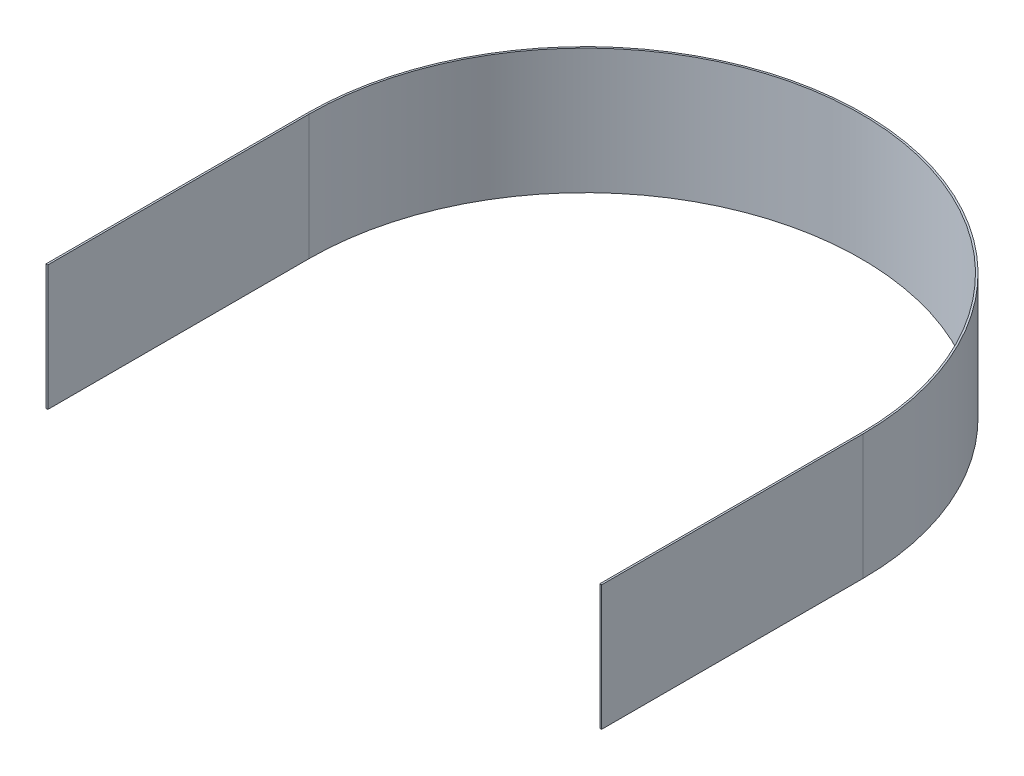
ISO-10303-21;
HEADER;
FILE_DESCRIPTION(('STEP AP214'),'2;1');
FILE_NAME('part.step','',(''),(''),'','','');
FILE_SCHEMA(('AUTOMOTIVE_DESIGN { 1 0 10303 214 1 1 1 1 }'));
ENDSEC;
DATA;
#1=APPLICATION_CONTEXT('core data for automotive mechanical design processes');
#2=APPLICATION_PROTOCOL_DEFINITION('international standard','automotive_design',2000,#1);
#3=PRODUCT_CONTEXT('',#1,'mechanical');
#4=PRODUCT('Part','Part','',(#3));
#5=PRODUCT_RELATED_PRODUCT_CATEGORY('part','',(#4));
#6=PRODUCT_DEFINITION_FORMATION('','',#4);
#7=PRODUCT_DEFINITION_CONTEXT('part definition',#1,'design');
#8=PRODUCT_DEFINITION('design','',#6,#7);
#9=PRODUCT_DEFINITION_SHAPE('','',#8);
#10=(LENGTH_UNIT() NAMED_UNIT(*) SI_UNIT(.MILLI.,.METRE.));
#11=(NAMED_UNIT(*) PLANE_ANGLE_UNIT() SI_UNIT($,.RADIAN.));
#12=(NAMED_UNIT(*) SI_UNIT($,.STERADIAN.) SOLID_ANGLE_UNIT());
#13=UNCERTAINTY_MEASURE_WITH_UNIT(LENGTH_MEASURE(1.E-05),#10,'distance_accuracy_value','');
#14=(GEOMETRIC_REPRESENTATION_CONTEXT(3) GLOBAL_UNCERTAINTY_ASSIGNED_CONTEXT((#13)) GLOBAL_UNIT_ASSIGNED_CONTEXT((#10,
#11,#12)) REPRESENTATION_CONTEXT('',''));
#15=CARTESIAN_POINT('',(0.,0.,0.));
#16=DIRECTION('',(0.,0.,1.));
#17=DIRECTION('',(1.,0.,0.));
#18=AXIS2_PLACEMENT_3D('',#15,#16,#17);
#19=CARTESIAN_POINT('',(-154.328377409543,70.,146.0327375181));
#20=DIRECTION('',(-1.,0.,0.));
#21=DIRECTION('',(0.,0.,1.));
#22=AXIS2_PLACEMENT_3D('',#19,#20,#21);
#23=PLANE('',#22);
#24=DIRECTION('',(0.,0.,-1.));
#25=VECTOR('',#24,1.);
#26=CARTESIAN_POINT('',(-154.328377409543,0.,146.0327375181));
#27=LINE('',#26,#25);
#28=CARTESIAN_POINT('',(-154.328377409543,0.,146.0327375181));
#29=VERTEX_POINT('',#28);
#30=CARTESIAN_POINT('',(-154.328377409543,0.,0.));
#31=VERTEX_POINT('',#30);
#32=EDGE_CURVE('E128',#29,#31,#27,.T.);
#33=ORIENTED_EDGE('',*,*,#32,.T.);
#34=DIRECTION('',(0.,-1.,0.));
#35=VECTOR('',#34,1.);
#36=CARTESIAN_POINT('',(-154.328377409543,70.,0.));
#37=LINE('',#36,#35);
#38=CARTESIAN_POINT('',(-154.328377409543,70.,0.));
#39=VERTEX_POINT('',#38);
#40=EDGE_CURVE('E11',#39,#31,#37,.T.);
#41=ORIENTED_EDGE('',*,*,#40,.F.);
#42=DIRECTION('',(0.,0.,-1.));
#43=VECTOR('',#42,1.);
#44=CARTESIAN_POINT('',(-154.328377409543,70.,146.0327375181));
#45=LINE('',#44,#43);
#46=CARTESIAN_POINT('',(-154.328377409543,70.,146.0327375181));
#47=VERTEX_POINT('',#46);
#48=EDGE_CURVE('E142',#47,#39,#45,.T.);
#49=ORIENTED_EDGE('',*,*,#48,.F.);
#50=DIRECTION('',(0.,-1.,0.));
#51=VECTOR('',#50,1.);
#52=CARTESIAN_POINT('',(-154.328377409543,70.,146.0327375181));
#53=LINE('',#52,#51);
#54=EDGE_CURVE('E124',#47,#29,#53,.T.);
#55=ORIENTED_EDGE('',*,*,#54,.T.);
#56=EDGE_LOOP('',(#33,#41,#49,#55));
#57=FACE_BOUND('',#56,.T.);
#58=ADVANCED_FACE('F32',(#57),#23,.F.);
#59=CARTESIAN_POINT('',(0.,70.,0.));
#60=DIRECTION('',(0.,-1.,0.));
#61=DIRECTION('',(0.,0.,-1.));
#62=AXIS2_PLACEMENT_3D('',#59,#60,#61);
#63=CYLINDRICAL_SURFACE('',#62,154.328377409543);
#64=CARTESIAN_POINT('',(0.,0.,0.));
#65=DIRECTION('',(0.,-1.,0.));
#66=DIRECTION('',(0.,0.,-1.));
#67=AXIS2_PLACEMENT_3D('',#64,#65,#66);
#68=CIRCLE('',#67,154.328377409543);
#69=CARTESIAN_POINT('',(154.328377409543,0.,0.));
#70=VERTEX_POINT('',#69);
#71=EDGE_CURVE('E131',#31,#70,#68,.T.);
#72=ORIENTED_EDGE('',*,*,#71,.T.);
#73=DIRECTION('',(0.,-1.,0.));
#74=VECTOR('',#73,1.);
#75=CARTESIAN_POINT('',(154.328377409543,70.,0.));
#76=LINE('',#75,#74);
#77=CARTESIAN_POINT('',(154.328377409543,70.,0.));
#78=VERTEX_POINT('',#77);
#79=EDGE_CURVE('E40',#78,#70,#76,.T.);
#80=ORIENTED_EDGE('',*,*,#79,.F.);
#81=CARTESIAN_POINT('',(0.,70.,0.));
#82=DIRECTION('',(0.,-1.,0.));
#83=DIRECTION('',(0.,0.,-1.));
#84=AXIS2_PLACEMENT_3D('',#81,#82,#83);
#85=CIRCLE('',#84,154.328377409543);
#86=EDGE_CURVE('E91',#39,#78,#85,.T.);
#87=ORIENTED_EDGE('',*,*,#86,.F.);
#88=ORIENTED_EDGE('',*,*,#40,.T.);
#89=EDGE_LOOP('',(#72,#80,#87,#88));
#90=FACE_BOUND('',#89,.T.);
#91=ADVANCED_FACE('F177',(#90),#63,.F.);
#92=CARTESIAN_POINT('',(154.328377409543,70.,146.07627046515));
#93=DIRECTION('',(1.,0.,0.));
#94=DIRECTION('',(0.,0.,-1.));
#95=AXIS2_PLACEMENT_3D('',#92,#93,#94);
#96=PLANE('',#95);
#97=DIRECTION('',(0.,0.,1.));
#98=VECTOR('',#97,1.);
#99=CARTESIAN_POINT('',(154.328377409543,0.,146.07627046515));
#100=LINE('',#99,#98);
#101=CARTESIAN_POINT('',(154.328377409543,0.,146.07627046515));
#102=VERTEX_POINT('',#101);
#103=EDGE_CURVE('E133',#70,#102,#100,.T.);
#104=ORIENTED_EDGE('',*,*,#103,.T.);
#105=DIRECTION('',(0.,-1.,0.));
#106=VECTOR('',#105,1.);
#107=CARTESIAN_POINT('',(154.328377409543,70.,146.07627046515));
#108=LINE('',#107,#106);
#109=CARTESIAN_POINT('',(154.328377409543,70.,146.07627046515));
#110=VERTEX_POINT('',#109);
#111=EDGE_CURVE('E149',#110,#102,#108,.T.);
#112=ORIENTED_EDGE('',*,*,#111,.F.);
#113=DIRECTION('',(0.,0.,1.));
#114=VECTOR('',#113,1.);
#115=CARTESIAN_POINT('',(154.328377409543,70.,146.07627046515));
#116=LINE('',#115,#114);
#117=EDGE_CURVE('E157',#78,#110,#116,.T.);
#118=ORIENTED_EDGE('',*,*,#117,.F.);
#119=ORIENTED_EDGE('',*,*,#79,.T.);
#120=EDGE_LOOP('',(#104,#112,#118,#119));
#121=FACE_BOUND('',#120,.T.);
#122=ADVANCED_FACE('F155',(#121),#96,.F.);
#123=CARTESIAN_POINT('',(154.328377409543,70.,146.07627046515));
#124=DIRECTION('',(0.,0.,-1.));
#125=DIRECTION('',(-1.,0.,0.));
#126=AXIS2_PLACEMENT_3D('',#123,#124,#125);
#127=PLANE('',#126);
#128=DIRECTION('',(1.,0.,0.));
#129=VECTOR('',#128,1.);
#130=CARTESIAN_POINT('',(154.328377409543,0.,146.07627046515));
#131=LINE('',#130,#129);
#132=CARTESIAN_POINT('',(155.328377409543,0.,146.07627046515));
#133=VERTEX_POINT('',#132);
#134=EDGE_CURVE('E135',#102,#133,#131,.T.);
#135=ORIENTED_EDGE('',*,*,#134,.T.);
#136=DIRECTION('',(0.,-1.,0.));
#137=VECTOR('',#136,1.);
#138=CARTESIAN_POINT('',(155.328377409543,70.,146.07627046515));
#139=LINE('',#138,#137);
#140=CARTESIAN_POINT('',(155.328377409543,70.,146.07627046515));
#141=VERTEX_POINT('',#140);
#142=EDGE_CURVE('E146',#141,#133,#139,.T.);
#143=ORIENTED_EDGE('',*,*,#142,.F.);
#144=DIRECTION('',(1.,0.,0.));
#145=VECTOR('',#144,1.);
#146=CARTESIAN_POINT('',(154.328377409543,70.,146.07627046515));
#147=LINE('',#146,#145);
#148=EDGE_CURVE('E169',#110,#141,#147,.T.);
#149=ORIENTED_EDGE('',*,*,#148,.F.);
#150=ORIENTED_EDGE('',*,*,#111,.T.);
#151=EDGE_LOOP('',(#135,#143,#149,#150));
#152=FACE_BOUND('',#151,.T.);
#153=ADVANCED_FACE('F165',(#152),#127,.F.);
#154=CARTESIAN_POINT('',(155.328377409543,70.,146.07627046515));
#155=DIRECTION('',(-1.,0.,0.));
#156=DIRECTION('',(0.,0.,1.));
#157=AXIS2_PLACEMENT_3D('',#154,#155,#156);
#158=PLANE('',#157);
#159=DIRECTION('',(0.,0.,-1.));
#160=VECTOR('',#159,1.);
#161=CARTESIAN_POINT('',(155.328377409543,0.,146.07627046515));
#162=LINE('',#161,#160);
#163=CARTESIAN_POINT('',(155.328377409543,0.,0.));
#164=VERTEX_POINT('',#163);
#165=EDGE_CURVE('E137',#133,#164,#162,.T.);
#166=ORIENTED_EDGE('',*,*,#165,.T.);
#167=DIRECTION('',(0.,-1.,0.));
#168=VECTOR('',#167,1.);
#169=CARTESIAN_POINT('',(155.328377409543,70.,0.));
#170=LINE('',#169,#168);
#171=CARTESIAN_POINT('',(155.328377409543,70.,0.));
#172=VERTEX_POINT('',#171);
#173=EDGE_CURVE('E119',#172,#164,#170,.T.);
#174=ORIENTED_EDGE('',*,*,#173,.F.);
#175=DIRECTION('',(0.,0.,-1.));
#176=VECTOR('',#175,1.);
#177=CARTESIAN_POINT('',(155.328377409543,70.,146.07627046515));
#178=LINE('',#177,#176);
#179=EDGE_CURVE('E110',#141,#172,#178,.T.);
#180=ORIENTED_EDGE('',*,*,#179,.F.);
#181=ORIENTED_EDGE('',*,*,#142,.T.);
#182=EDGE_LOOP('',(#166,#174,#180,#181));
#183=FACE_BOUND('',#182,.T.);
#184=ADVANCED_FACE('F168',(#183),#158,.F.);
#185=CARTESIAN_POINT('',(0.,70.,0.));
#186=DIRECTION('',(0.,-1.,0.));
#187=DIRECTION('',(0.,0.,-1.));
#188=AXIS2_PLACEMENT_3D('',#185,#186,#187);
#189=CYLINDRICAL_SURFACE('',#188,155.328377409543);
#190=CARTESIAN_POINT('',(0.,0.,0.));
#191=DIRECTION('',(0.,1.,0.));
#192=DIRECTION('',(0.,0.,-1.));
#193=AXIS2_PLACEMENT_3D('',#190,#191,#192);
#194=CIRCLE('',#193,155.328377409543);
#195=CARTESIAN_POINT('',(-155.328377409543,0.,0.));
#196=VERTEX_POINT('',#195);
#197=EDGE_CURVE('E118',#164,#196,#194,.T.);
#198=ORIENTED_EDGE('',*,*,#197,.T.);
#199=DIRECTION('',(0.,-1.,0.));
#200=VECTOR('',#199,1.);
#201=CARTESIAN_POINT('',(-155.328377409543,70.,0.));
#202=LINE('',#201,#200);
#203=CARTESIAN_POINT('',(-155.328377409543,70.,0.));
#204=VERTEX_POINT('',#203);
#205=EDGE_CURVE('E115',#204,#196,#202,.T.);
#206=ORIENTED_EDGE('',*,*,#205,.F.);
#207=CARTESIAN_POINT('',(0.,70.,0.));
#208=DIRECTION('',(0.,1.,0.));
#209=DIRECTION('',(0.,0.,-1.));
#210=AXIS2_PLACEMENT_3D('',#207,#208,#209);
#211=CIRCLE('',#210,155.328377409543);
#212=EDGE_CURVE('E104',#172,#204,#211,.T.);
#213=ORIENTED_EDGE('',*,*,#212,.F.);
#214=ORIENTED_EDGE('',*,*,#173,.T.);
#215=EDGE_LOOP('',(#198,#206,#213,#214));
#216=FACE_BOUND('',#215,.T.);
#217=ADVANCED_FACE('F116',(#216),#189,.T.);
#218=CARTESIAN_POINT('',(-155.328377409543,70.,146.0327375181));
#219=DIRECTION('',(1.,0.,0.));
#220=DIRECTION('',(0.,0.,-1.));
#221=AXIS2_PLACEMENT_3D('',#218,#219,#220);
#222=PLANE('',#221);
#223=DIRECTION('',(0.,0.,1.));
#224=VECTOR('',#223,1.);
#225=CARTESIAN_POINT('',(-155.328377409543,0.,146.0327375181));
#226=LINE('',#225,#224);
#227=CARTESIAN_POINT('',(-155.328377409543,0.,146.0327375181));
#228=VERTEX_POINT('',#227);
#229=EDGE_CURVE('E77',#196,#228,#226,.T.);
#230=ORIENTED_EDGE('',*,*,#229,.T.);
#231=DIRECTION('',(0.,-1.,0.));
#232=VECTOR('',#231,1.);
#233=CARTESIAN_POINT('',(-155.328377409543,70.,146.0327375181));
#234=LINE('',#233,#232);
#235=CARTESIAN_POINT('',(-155.328377409543,70.,146.0327375181));
#236=VERTEX_POINT('',#235);
#237=EDGE_CURVE('E120',#236,#228,#234,.T.);
#238=ORIENTED_EDGE('',*,*,#237,.F.);
#239=DIRECTION('',(0.,0.,1.));
#240=VECTOR('',#239,1.);
#241=CARTESIAN_POINT('',(-155.328377409543,70.,146.0327375181));
#242=LINE('',#241,#240);
#243=EDGE_CURVE('E108',#204,#236,#242,.T.);
#244=ORIENTED_EDGE('',*,*,#243,.F.);
#245=ORIENTED_EDGE('',*,*,#205,.T.);
#246=EDGE_LOOP('',(#230,#238,#244,#245));
#247=FACE_BOUND('',#246,.T.);
#248=ADVANCED_FACE('F122',(#247),#222,.F.);
#249=CARTESIAN_POINT('',(-154.328377409543,70.,146.0327375181));
#250=DIRECTION('',(0.,0.,-1.));
#251=DIRECTION('',(-1.,0.,0.));
#252=AXIS2_PLACEMENT_3D('',#249,#250,#251);
#253=PLANE('',#252);
#254=DIRECTION('',(1.,0.,0.));
#255=VECTOR('',#254,1.);
#256=CARTESIAN_POINT('',(-154.328377409543,0.,146.0327375181));
#257=LINE('',#256,#255);
#258=EDGE_CURVE('E83',#228,#29,#257,.T.);
#259=ORIENTED_EDGE('',*,*,#258,.T.);
#260=ORIENTED_EDGE('',*,*,#54,.F.);
#261=DIRECTION('',(1.,0.,0.));
#262=VECTOR('',#261,1.);
#263=CARTESIAN_POINT('',(-154.328377409543,70.,146.0327375181));
#264=LINE('',#263,#262);
#265=EDGE_CURVE('E48',#236,#47,#264,.T.);
#266=ORIENTED_EDGE('',*,*,#265,.F.);
#267=ORIENTED_EDGE('',*,*,#237,.T.);
#268=EDGE_LOOP('',(#259,#260,#266,#267));
#269=FACE_BOUND('',#268,.T.);
#270=ADVANCED_FACE('F193',(#269),#253,.F.);
#271=CARTESIAN_POINT('',(0.,70.,0.));
#272=DIRECTION('',(0.,-1.,0.));
#273=DIRECTION('',(0.,0.,-1.));
#274=AXIS2_PLACEMENT_3D('',#271,#272,#273);
#275=PLANE('',#274);
#276=ORIENTED_EDGE('',*,*,#48,.T.);
#277=ORIENTED_EDGE('',*,*,#86,.T.);
#278=ORIENTED_EDGE('',*,*,#117,.T.);
#279=ORIENTED_EDGE('',*,*,#148,.T.);
#280=ORIENTED_EDGE('',*,*,#179,.T.);
#281=ORIENTED_EDGE('',*,*,#212,.T.);
#282=ORIENTED_EDGE('',*,*,#243,.T.);
#283=ORIENTED_EDGE('',*,*,#265,.T.);
#284=EDGE_LOOP('',(#276,#277,#278,#279,#280,#281,#282,#283));
#285=FACE_BOUND('',#284,.T.);
#286=ADVANCED_FACE('F106',(#285),#275,.F.);
#287=CARTESIAN_POINT('',(0.,0.,0.));
#288=DIRECTION('',(0.,-1.,0.));
#289=DIRECTION('',(0.,0.,-1.));
#290=AXIS2_PLACEMENT_3D('',#287,#288,#289);
#291=PLANE('',#290);
#292=ORIENTED_EDGE('',*,*,#32,.F.);
#293=ORIENTED_EDGE('',*,*,#258,.F.);
#294=ORIENTED_EDGE('',*,*,#229,.F.);
#295=ORIENTED_EDGE('',*,*,#197,.F.);
#296=ORIENTED_EDGE('',*,*,#165,.F.);
#297=ORIENTED_EDGE('',*,*,#134,.F.);
#298=ORIENTED_EDGE('',*,*,#103,.F.);
#299=ORIENTED_EDGE('',*,*,#71,.F.);
#300=EDGE_LOOP('',(#292,#293,#294,#295,#296,#297,#298,#299));
#301=FACE_BOUND('',#300,.T.);
#302=ADVANCED_FACE('F161',(#301),#291,.T.);
#303=CLOSED_SHELL('',(#58,#91,#122,#153,#184,#217,#248,#270,#286,#302));
#304=MANIFOLD_SOLID_BREP('B2',#303);
#305=ADVANCED_BREP_SHAPE_REPRESENTATION('',(#18,#304),#14);
#306=SHAPE_DEFINITION_REPRESENTATION(#9,#305);
ENDSEC;
END-ISO-10303-21;
